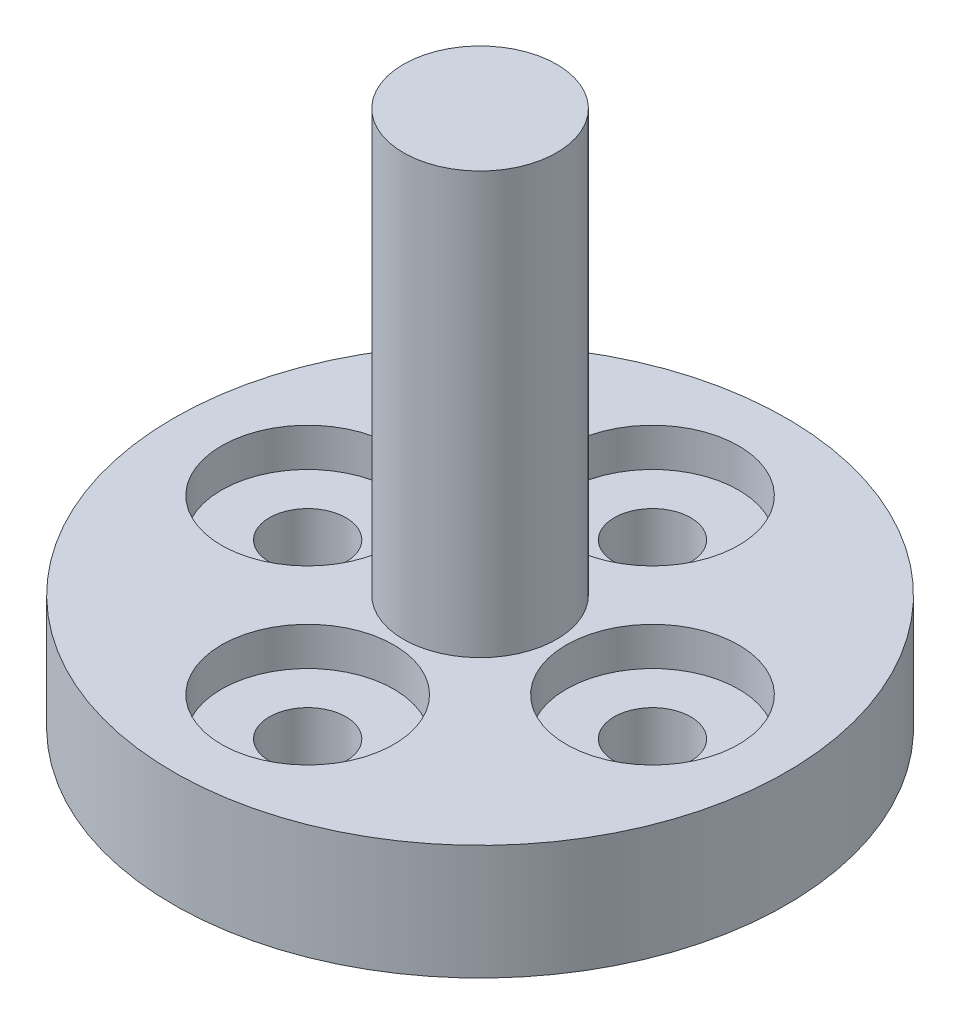
ISO-10303-21;
HEADER;
FILE_DESCRIPTION(('STEP AP214'),'2;1');
FILE_NAME('part.step','',(''),(''),'','','');
FILE_SCHEMA(('AUTOMOTIVE_DESIGN { 1 0 10303 214 1 1 1 1 }'));
ENDSEC;
DATA;
#1=APPLICATION_CONTEXT('core data for automotive mechanical design processes');
#2=APPLICATION_PROTOCOL_DEFINITION('international standard','automotive_design',2000,#1);
#3=PRODUCT_CONTEXT('',#1,'mechanical');
#4=PRODUCT('Part','Part','',(#3));
#5=PRODUCT_RELATED_PRODUCT_CATEGORY('part','',(#4));
#6=PRODUCT_DEFINITION_FORMATION('','',#4);
#7=PRODUCT_DEFINITION_CONTEXT('part definition',#1,'design');
#8=PRODUCT_DEFINITION('design','',#6,#7);
#9=PRODUCT_DEFINITION_SHAPE('','',#8);
#10=(LENGTH_UNIT() NAMED_UNIT(*) SI_UNIT(.MILLI.,.METRE.));
#11=(NAMED_UNIT(*) PLANE_ANGLE_UNIT() SI_UNIT($,.RADIAN.));
#12=(NAMED_UNIT(*) SI_UNIT($,.STERADIAN.) SOLID_ANGLE_UNIT());
#13=UNCERTAINTY_MEASURE_WITH_UNIT(LENGTH_MEASURE(1.E-05),#10,'distance_accuracy_value','');
#14=(GEOMETRIC_REPRESENTATION_CONTEXT(3) GLOBAL_UNCERTAINTY_ASSIGNED_CONTEXT((#13)) GLOBAL_UNIT_ASSIGNED_CONTEXT((#10,
#11,#12)) REPRESENTATION_CONTEXT('',''));
#15=CARTESIAN_POINT('',(0.,0.,0.));
#16=DIRECTION('',(0.,0.,1.));
#17=DIRECTION('',(1.,0.,0.));
#18=AXIS2_PLACEMENT_3D('',#15,#16,#17);
#19=CARTESIAN_POINT('',(-4.49999999999987,0.,1.2762214690701E-13));
#20=DIRECTION('',(0.,1.,0.));
#21=DIRECTION('',(-1.,0.,0.));
#22=AXIS2_PLACEMENT_3D('',#19,#20,#21);
#23=CYLINDRICAL_SURFACE('',#22,1.0000000000002);
#24=CARTESIAN_POINT('',(-4.49999999999987,0.,1.2762214690701E-13));
#25=DIRECTION('',(0.,1.,0.));
#26=DIRECTION('',(-1.,0.,0.));
#27=AXIS2_PLACEMENT_3D('',#24,#25,#26);
#28=CIRCLE('',#27,1.0000000000002);
#29=CARTESIAN_POINT('',(-5.50000000000008,0.,1.2762214690701E-13));
#30=VERTEX_POINT('',#29);
#31=EDGE_CURVE('E69',#30,#30,#28,.T.);
#32=ORIENTED_EDGE('',*,*,#31,.F.);
#33=EDGE_LOOP('',(#32));
#34=FACE_BOUND('',#33,.T.);
#35=CARTESIAN_POINT('',(-4.49999999999987,2.,1.2762214690701E-13));
#36=DIRECTION('',(0.,1.,0.));
#37=DIRECTION('',(-1.,0.,0.));
#38=AXIS2_PLACEMENT_3D('',#35,#36,#37);
#39=CIRCLE('',#38,1.0000000000002);
#40=CARTESIAN_POINT('',(-5.50000000000008,2.,1.2762214690701E-13));
#41=VERTEX_POINT('',#40);
#42=EDGE_CURVE('E45',#41,#41,#39,.F.);
#43=ORIENTED_EDGE('',*,*,#42,.F.);
#44=EDGE_LOOP('',(#43));
#45=FACE_BOUND('',#44,.T.);
#46=ADVANCED_FACE('F41',(#34,#45),#23,.F.);
#47=CARTESIAN_POINT('',(2.54142111694787E-13,0.,4.5));
#48=DIRECTION('',(0.,1.,0.));
#49=DIRECTION('',(-1.,0.,0.));
#50=AXIS2_PLACEMENT_3D('',#47,#48,#49);
#51=CYLINDRICAL_SURFACE('',#50,1.00000000000027);
#52=CARTESIAN_POINT('',(2.54142111694787E-13,0.,4.5));
#53=DIRECTION('',(0.,1.,0.));
#54=DIRECTION('',(-1.,0.,0.));
#55=AXIS2_PLACEMENT_3D('',#52,#53,#54);
#56=CIRCLE('',#55,1.00000000000027);
#57=CARTESIAN_POINT('',(-1.00000000000002,0.,4.5));
#58=VERTEX_POINT('',#57);
#59=EDGE_CURVE('E73',#58,#58,#56,.T.);
#60=ORIENTED_EDGE('',*,*,#59,.F.);
#61=EDGE_LOOP('',(#60));
#62=FACE_BOUND('',#61,.T.);
#63=CARTESIAN_POINT('',(2.54018202875074E-13,2.,4.5));
#64=DIRECTION('',(0.,1.,0.));
#65=DIRECTION('',(-1.,0.,0.));
#66=AXIS2_PLACEMENT_3D('',#63,#64,#65);
#67=CIRCLE('',#66,1.00000000000027);
#68=CARTESIAN_POINT('',(-1.00000000000002,2.,4.5));
#69=VERTEX_POINT('',#68);
#70=EDGE_CURVE('E64',#69,#69,#67,.F.);
#71=ORIENTED_EDGE('',*,*,#70,.F.);
#72=EDGE_LOOP('',(#71));
#73=FACE_BOUND('',#72,.T.);
#74=ADVANCED_FACE('F105',(#62,#73),#51,.F.);
#75=CARTESIAN_POINT('',(4.50000000000013,0.,-1.27071055847394E-13));
#76=DIRECTION('',(0.,1.,0.));
#77=DIRECTION('',(-1.,0.,0.));
#78=AXIS2_PLACEMENT_3D('',#75,#76,#77);
#79=CYLINDRICAL_SURFACE('',#78,1.0000000000001);
#80=CARTESIAN_POINT('',(4.50000000000013,0.,-1.27071055847394E-13));
#81=DIRECTION('',(0.,1.,0.));
#82=DIRECTION('',(-1.,0.,0.));
#83=AXIS2_PLACEMENT_3D('',#80,#81,#82);
#84=CIRCLE('',#83,1.0000000000001);
#85=CARTESIAN_POINT('',(3.50000000000003,0.,-1.27071055847394E-13));
#86=VERTEX_POINT('',#85);
#87=EDGE_CURVE('E78',#86,#86,#84,.T.);
#88=ORIENTED_EDGE('',*,*,#87,.F.);
#89=EDGE_LOOP('',(#88));
#90=FACE_BOUND('',#89,.T.);
#91=CARTESIAN_POINT('',(4.50000000000013,2.,-1.27071055847394E-13));
#92=DIRECTION('',(0.,1.,0.));
#93=DIRECTION('',(-1.,0.,0.));
#94=AXIS2_PLACEMENT_3D('',#91,#92,#93);
#95=CIRCLE('',#94,1.0000000000001);
#96=CARTESIAN_POINT('',(3.50000000000003,2.,-1.27071055847394E-13));
#97=VERTEX_POINT('',#96);
#98=EDGE_CURVE('E61',#97,#97,#95,.F.);
#99=ORIENTED_EDGE('',*,*,#98,.F.);
#100=EDGE_LOOP('',(#99));
#101=FACE_BOUND('',#100,.T.);
#102=ADVANCED_FACE('F111',(#90,#101),#79,.F.);
#103=CARTESIAN_POINT('',(0.,0.,-4.5));
#104=DIRECTION('',(0.,1.,0.));
#105=DIRECTION('',(-1.,0.,0.));
#106=AXIS2_PLACEMENT_3D('',#103,#104,#105);
#107=CYLINDRICAL_SURFACE('',#106,1.);
#108=CARTESIAN_POINT('',(0.,0.,-4.5));
#109=DIRECTION('',(0.,1.,0.));
#110=DIRECTION('',(-1.,0.,0.));
#111=AXIS2_PLACEMENT_3D('',#108,#109,#110);
#112=CIRCLE('',#111,1.);
#113=CARTESIAN_POINT('',(-1.,0.,-4.5));
#114=VERTEX_POINT('',#113);
#115=EDGE_CURVE('E84',#114,#114,#112,.T.);
#116=ORIENTED_EDGE('',*,*,#115,.F.);
#117=EDGE_LOOP('',(#116));
#118=FACE_BOUND('',#117,.T.);
#119=CARTESIAN_POINT('',(0.,2.,-4.5));
#120=DIRECTION('',(0.,1.,0.));
#121=DIRECTION('',(-1.,0.,0.));
#122=AXIS2_PLACEMENT_3D('',#119,#120,#121);
#123=CIRCLE('',#122,1.);
#124=CARTESIAN_POINT('',(-1.,2.,-4.5));
#125=VERTEX_POINT('',#124);
#126=EDGE_CURVE('E58',#125,#125,#123,.F.);
#127=ORIENTED_EDGE('',*,*,#126,.F.);
#128=EDGE_LOOP('',(#127));
#129=FACE_BOUND('',#128,.T.);
#130=ADVANCED_FACE('F102',(#118,#129),#107,.F.);
#131=CARTESIAN_POINT('',(0.,0.,0.));
#132=DIRECTION('',(0.,1.,0.));
#133=DIRECTION('',(-1.,0.,0.));
#134=AXIS2_PLACEMENT_3D('',#131,#132,#133);
#135=PLANE('',#134);
#136=ORIENTED_EDGE('',*,*,#115,.T.);
#137=EDGE_LOOP('',(#136));
#138=FACE_BOUND('',#137,.T.);
#139=ORIENTED_EDGE('',*,*,#87,.T.);
#140=EDGE_LOOP('',(#139));
#141=FACE_BOUND('',#140,.T.);
#142=ORIENTED_EDGE('',*,*,#59,.T.);
#143=EDGE_LOOP('',(#142));
#144=FACE_BOUND('',#143,.T.);
#145=ORIENTED_EDGE('',*,*,#31,.T.);
#146=EDGE_LOOP('',(#145));
#147=FACE_BOUND('',#146,.T.);
#148=CARTESIAN_POINT('',(0.,0.,0.));
#149=DIRECTION('',(0.,1.,0.));
#150=DIRECTION('',(-1.,0.,0.));
#151=AXIS2_PLACEMENT_3D('',#148,#149,#150);
#152=CIRCLE('',#151,8.);
#153=CARTESIAN_POINT('',(-8.,0.,0.));
#154=VERTEX_POINT('',#153);
#155=EDGE_CURVE('E10',#154,#154,#152,.T.);
#156=ORIENTED_EDGE('',*,*,#155,.F.);
#157=EDGE_LOOP('',(#156));
#158=FACE_BOUND('',#157,.T.);
#159=ADVANCED_FACE('F43',(#138,#141,#144,#147,#158),#135,.F.);
#160=CARTESIAN_POINT('',(0.,14.,0.));
#161=DIRECTION('',(0.,1.,0.));
#162=DIRECTION('',(-1.,0.,0.));
#163=AXIS2_PLACEMENT_3D('',#160,#161,#162);
#164=CYLINDRICAL_SURFACE('',#163,8.);
#165=CARTESIAN_POINT('',(0.,3.,0.));
#166=DIRECTION('',(0.,1.,0.));
#167=DIRECTION('',(-1.,0.,0.));
#168=AXIS2_PLACEMENT_3D('',#165,#166,#167);
#169=CIRCLE('',#168,8.);
#170=CARTESIAN_POINT('',(-8.,3.,0.));
#171=VERTEX_POINT('',#170);
#172=EDGE_CURVE('E49',#171,#171,#169,.T.);
#173=ORIENTED_EDGE('',*,*,#172,.F.);
#174=EDGE_LOOP('',(#173));
#175=FACE_BOUND('',#174,.T.);
#176=ORIENTED_EDGE('',*,*,#155,.T.);
#177=EDGE_LOOP('',(#176));
#178=FACE_BOUND('',#177,.T.);
#179=ADVANCED_FACE('F93',(#175,#178),#164,.T.);
#180=CARTESIAN_POINT('',(8.,3.,0.));
#181=DIRECTION('',(0.,-1.,0.));
#182=DIRECTION('',(1.,0.,0.));
#183=AXIS2_PLACEMENT_3D('',#180,#181,#182);
#184=PLANE('',#183);
#185=CARTESIAN_POINT('',(1.260585560284E-13,3.,4.5));
#186=DIRECTION('',(0.,1.,0.));
#187=DIRECTION('',(-1.,0.,0.));
#188=AXIS2_PLACEMENT_3D('',#185,#186,#187);
#189=CIRCLE('',#188,2.25000000000015);
#190=CARTESIAN_POINT('',(-2.25000000000002,3.,4.5));
#191=VERTEX_POINT('',#190);
#192=EDGE_CURVE('E310',#191,#191,#189,.T.);
#193=ORIENTED_EDGE('',*,*,#192,.F.);
#194=EDGE_LOOP('',(#193));
#195=FACE_BOUND('',#194,.T.);
#196=CARTESIAN_POINT('',(4.5,3.,0.));
#197=DIRECTION('',(0.,1.,0.));
#198=DIRECTION('',(-1.,0.,0.));
#199=AXIS2_PLACEMENT_3D('',#196,#197,#198);
#200=CIRCLE('',#199,2.25);
#201=CARTESIAN_POINT('',(2.25,3.,0.));
#202=VERTEX_POINT('',#201);
#203=EDGE_CURVE('E304',#202,#202,#200,.T.);
#204=ORIENTED_EDGE('',*,*,#203,.F.);
#205=EDGE_LOOP('',(#204));
#206=FACE_BOUND('',#205,.T.);
#207=CARTESIAN_POINT('',(-4.5,3.,0.));
#208=DIRECTION('',(0.,1.,0.));
#209=DIRECTION('',(-1.,0.,0.));
#210=AXIS2_PLACEMENT_3D('',#207,#208,#209);
#211=CIRCLE('',#210,2.25);
#212=CARTESIAN_POINT('',(-6.75,3.,0.));
#213=VERTEX_POINT('',#212);
#214=EDGE_CURVE('E316',#213,#213,#211,.T.);
#215=ORIENTED_EDGE('',*,*,#214,.F.);
#216=EDGE_LOOP('',(#215));
#217=FACE_BOUND('',#216,.T.);
#218=CARTESIAN_POINT('',(0.,3.,-4.5));
#219=DIRECTION('',(0.,1.,0.));
#220=DIRECTION('',(-1.,0.,0.));
#221=AXIS2_PLACEMENT_3D('',#218,#219,#220);
#222=CIRCLE('',#221,2.25);
#223=CARTESIAN_POINT('',(-2.25,3.,-4.5));
#224=VERTEX_POINT('',#223);
#225=EDGE_CURVE('E301',#224,#224,#222,.T.);
#226=ORIENTED_EDGE('',*,*,#225,.F.);
#227=EDGE_LOOP('',(#226));
#228=FACE_BOUND('',#227,.T.);
#229=CARTESIAN_POINT('',(0.,3.,0.));
#230=DIRECTION('',(0.,1.,0.));
#231=DIRECTION('',(-1.,0.,0.));
#232=AXIS2_PLACEMENT_3D('',#229,#230,#231);
#233=CIRCLE('',#232,2.);
#234=CARTESIAN_POINT('',(-2.,3.,0.));
#235=VERTEX_POINT('',#234);
#236=EDGE_CURVE('E54',#235,#235,#233,.T.);
#237=ORIENTED_EDGE('',*,*,#236,.F.);
#238=EDGE_LOOP('',(#237));
#239=FACE_BOUND('',#238,.T.);
#240=ORIENTED_EDGE('',*,*,#172,.T.);
#241=EDGE_LOOP('',(#240));
#242=FACE_BOUND('',#241,.T.);
#243=ADVANCED_FACE('F90',(#195,#206,#217,#228,#239,#242),#184,.F.);
#244=CARTESIAN_POINT('',(0.,14.,0.));
#245=DIRECTION('',(0.,1.,0.));
#246=DIRECTION('',(-1.,0.,0.));
#247=AXIS2_PLACEMENT_3D('',#244,#245,#246);
#248=CYLINDRICAL_SURFACE('',#247,2.);
#249=CARTESIAN_POINT('',(0.,14.,0.));
#250=DIRECTION('',(0.,1.,0.));
#251=DIRECTION('',(-1.,0.,0.));
#252=AXIS2_PLACEMENT_3D('',#249,#250,#251);
#253=CIRCLE('',#252,2.);
#254=CARTESIAN_POINT('',(-2.,14.,0.));
#255=VERTEX_POINT('',#254);
#256=EDGE_CURVE('E82',#255,#255,#253,.T.);
#257=ORIENTED_EDGE('',*,*,#256,.F.);
#258=EDGE_LOOP('',(#257));
#259=FACE_BOUND('',#258,.T.);
#260=ORIENTED_EDGE('',*,*,#236,.T.);
#261=EDGE_LOOP('',(#260));
#262=FACE_BOUND('',#261,.T.);
#263=ADVANCED_FACE('F88',(#259,#262),#248,.T.);
#264=CARTESIAN_POINT('',(2.,14.,0.));
#265=DIRECTION('',(0.,-1.,0.));
#266=DIRECTION('',(1.,0.,0.));
#267=AXIS2_PLACEMENT_3D('',#264,#265,#266);
#268=PLANE('',#267);
#269=ORIENTED_EDGE('',*,*,#256,.T.);
#270=EDGE_LOOP('',(#269));
#271=FACE_BOUND('',#270,.T.);
#272=ADVANCED_FACE('F117',(#271),#268,.F.);
#273=CARTESIAN_POINT('',(0.,2.,-4.5));
#274=DIRECTION('',(0.,1.,0.));
#275=DIRECTION('',(-1.,0.,0.));
#276=AXIS2_PLACEMENT_3D('',#273,#274,#275);
#277=PLANE('',#276);
#278=CARTESIAN_POINT('',(0.,2.,-4.5));
#279=DIRECTION('',(0.,1.,0.));
#280=DIRECTION('',(-1.,0.,0.));
#281=AXIS2_PLACEMENT_3D('',#278,#279,#280);
#282=CIRCLE('',#281,2.25);
#283=CARTESIAN_POINT('',(-2.25,2.,-4.5));
#284=VERTEX_POINT('',#283);
#285=EDGE_CURVE('E62',#284,#284,#282,.T.);
#286=ORIENTED_EDGE('',*,*,#285,.T.);
#287=EDGE_LOOP('',(#286));
#288=FACE_BOUND('',#287,.T.);
#289=ORIENTED_EDGE('',*,*,#126,.T.);
#290=EDGE_LOOP('',(#289));
#291=FACE_BOUND('',#290,.T.);
#292=ADVANCED_FACE('F120',(#288,#291),#277,.T.);
#293=CARTESIAN_POINT('',(0.,2.,-4.5));
#294=DIRECTION('',(0.,1.,0.));
#295=DIRECTION('',(-1.,0.,0.));
#296=AXIS2_PLACEMENT_3D('',#293,#294,#295);
#297=CYLINDRICAL_SURFACE('',#296,2.25);
#298=ORIENTED_EDGE('',*,*,#285,.F.);
#299=EDGE_LOOP('',(#298));
#300=FACE_BOUND('',#299,.T.);
#301=ORIENTED_EDGE('',*,*,#225,.T.);
#302=EDGE_LOOP('',(#301));
#303=FACE_BOUND('',#302,.T.);
#304=ADVANCED_FACE('F140',(#300,#303),#297,.F.);
#305=CARTESIAN_POINT('',(4.5,2.,0.));
#306=DIRECTION('',(0.,1.,0.));
#307=DIRECTION('',(-1.,0.,0.));
#308=AXIS2_PLACEMENT_3D('',#305,#306,#307);
#309=PLANE('',#308);
#310=CARTESIAN_POINT('',(4.5,2.,0.));
#311=DIRECTION('',(0.,1.,0.));
#312=DIRECTION('',(-1.,0.,0.));
#313=AXIS2_PLACEMENT_3D('',#310,#311,#312);
#314=CIRCLE('',#313,2.25);
#315=CARTESIAN_POINT('',(2.25,2.,0.));
#316=VERTEX_POINT('',#315);
#317=EDGE_CURVE('E307',#316,#316,#314,.T.);
#318=ORIENTED_EDGE('',*,*,#317,.T.);
#319=EDGE_LOOP('',(#318));
#320=FACE_BOUND('',#319,.T.);
#321=ORIENTED_EDGE('',*,*,#98,.T.);
#322=EDGE_LOOP('',(#321));
#323=FACE_BOUND('',#322,.T.);
#324=ADVANCED_FACE('F148',(#320,#323),#309,.T.);
#325=CARTESIAN_POINT('',(4.5,2.,0.));
#326=DIRECTION('',(0.,1.,0.));
#327=DIRECTION('',(-1.,0.,0.));
#328=AXIS2_PLACEMENT_3D('',#325,#326,#327);
#329=CYLINDRICAL_SURFACE('',#328,2.25);
#330=ORIENTED_EDGE('',*,*,#317,.F.);
#331=EDGE_LOOP('',(#330));
#332=FACE_BOUND('',#331,.T.);
#333=ORIENTED_EDGE('',*,*,#203,.T.);
#334=EDGE_LOOP('',(#333));
#335=FACE_BOUND('',#334,.T.);
#336=ADVANCED_FACE('F156',(#332,#335),#329,.F.);
#337=CARTESIAN_POINT('',(1.26120510438257E-13,2.,4.5));
#338=DIRECTION('',(0.,1.,0.));
#339=DIRECTION('',(-1.,0.,0.));
#340=AXIS2_PLACEMENT_3D('',#337,#338,#339);
#341=PLANE('',#340);
#342=CARTESIAN_POINT('',(1.26120510438257E-13,2.,4.5));
#343=DIRECTION('',(0.,1.,0.));
#344=DIRECTION('',(-1.,0.,0.));
#345=AXIS2_PLACEMENT_3D('',#342,#343,#344);
#346=CIRCLE('',#345,2.25000000000015);
#347=CARTESIAN_POINT('',(-2.25000000000002,2.,4.5));
#348=VERTEX_POINT('',#347);
#349=EDGE_CURVE('E313',#348,#348,#346,.T.);
#350=ORIENTED_EDGE('',*,*,#349,.T.);
#351=EDGE_LOOP('',(#350));
#352=FACE_BOUND('',#351,.T.);
#353=ORIENTED_EDGE('',*,*,#70,.T.);
#354=EDGE_LOOP('',(#353));
#355=FACE_BOUND('',#354,.T.);
#356=ADVANCED_FACE('F164',(#352,#355),#341,.T.);
#357=CARTESIAN_POINT('',(1.26120510438257E-13,2.,4.5));
#358=DIRECTION('',(0.,1.,0.));
#359=DIRECTION('',(-1.,0.,0.));
#360=AXIS2_PLACEMENT_3D('',#357,#358,#359);
#361=CYLINDRICAL_SURFACE('',#360,2.25000000000015);
#362=ORIENTED_EDGE('',*,*,#349,.F.);
#363=EDGE_LOOP('',(#362));
#364=FACE_BOUND('',#363,.T.);
#365=ORIENTED_EDGE('',*,*,#192,.T.);
#366=EDGE_LOOP('',(#365));
#367=FACE_BOUND('',#366,.T.);
#368=ADVANCED_FACE('F172',(#364,#367),#361,.F.);
#369=CARTESIAN_POINT('',(-4.5,2.,0.));
#370=DIRECTION('',(0.,1.,0.));
#371=DIRECTION('',(-1.,0.,0.));
#372=AXIS2_PLACEMENT_3D('',#369,#370,#371);
#373=PLANE('',#372);
#374=CARTESIAN_POINT('',(-4.5,2.,0.));
#375=DIRECTION('',(0.,1.,0.));
#376=DIRECTION('',(-1.,0.,0.));
#377=AXIS2_PLACEMENT_3D('',#374,#375,#376);
#378=CIRCLE('',#377,2.25);
#379=CARTESIAN_POINT('',(-6.75,2.,0.));
#380=VERTEX_POINT('',#379);
#381=EDGE_CURVE('E319',#380,#380,#378,.T.);
#382=ORIENTED_EDGE('',*,*,#381,.T.);
#383=EDGE_LOOP('',(#382));
#384=FACE_BOUND('',#383,.T.);
#385=ORIENTED_EDGE('',*,*,#42,.T.);
#386=EDGE_LOOP('',(#385));
#387=FACE_BOUND('',#386,.T.);
#388=ADVANCED_FACE('F180',(#384,#387),#373,.T.);
#389=CARTESIAN_POINT('',(-4.5,2.,0.));
#390=DIRECTION('',(0.,1.,0.));
#391=DIRECTION('',(-1.,0.,0.));
#392=AXIS2_PLACEMENT_3D('',#389,#390,#391);
#393=CYLINDRICAL_SURFACE('',#392,2.25);
#394=ORIENTED_EDGE('',*,*,#381,.F.);
#395=EDGE_LOOP('',(#394));
#396=FACE_BOUND('',#395,.T.);
#397=ORIENTED_EDGE('',*,*,#214,.T.);
#398=EDGE_LOOP('',(#397));
#399=FACE_BOUND('',#398,.T.);
#400=ADVANCED_FACE('F188',(#396,#399),#393,.F.);
#401=CLOSED_SHELL('',(#46,#74,#102,#130,#159,#179,#243,#263,#272,#292,#304,#324,#336,#356,#368,
#388,#400));
#402=MANIFOLD_SOLID_BREP('B2',#401);
#403=ADVANCED_BREP_SHAPE_REPRESENTATION('',(#18,#402),#14);
#404=SHAPE_DEFINITION_REPRESENTATION(#9,#403);
ENDSEC;
END-ISO-10303-21;
